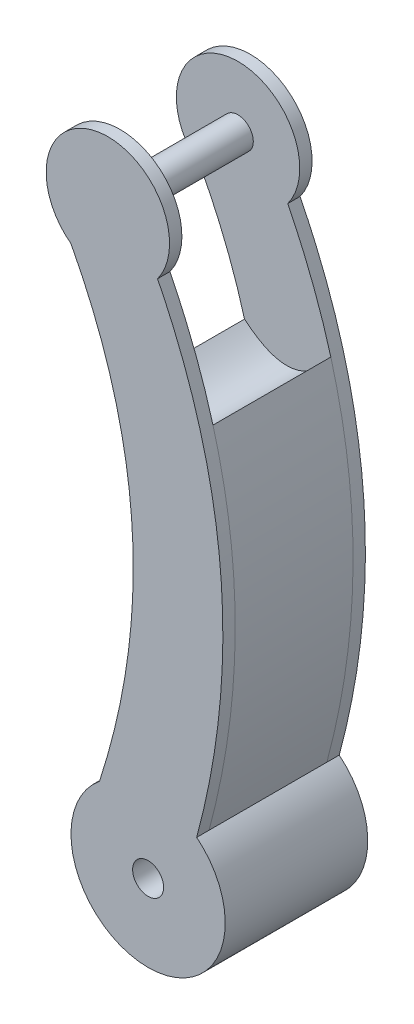
ISO-10303-21;
HEADER;
FILE_DESCRIPTION(('STEP AP214'),'2;1');
FILE_NAME('part.step','',(''),(''),'','','');
FILE_SCHEMA(('AUTOMOTIVE_DESIGN { 1 0 10303 214 1 1 1 1 }'));
ENDSEC;
DATA;
#1=APPLICATION_CONTEXT('core data for automotive mechanical design processes');
#2=APPLICATION_PROTOCOL_DEFINITION('international standard','automotive_design',2000,#1);
#3=PRODUCT_CONTEXT('',#1,'mechanical');
#4=PRODUCT('Part','Part','',(#3));
#5=PRODUCT_RELATED_PRODUCT_CATEGORY('part','',(#4));
#6=PRODUCT_DEFINITION_FORMATION('','',#4);
#7=PRODUCT_DEFINITION_CONTEXT('part definition',#1,'design');
#8=PRODUCT_DEFINITION('design','',#6,#7);
#9=PRODUCT_DEFINITION_SHAPE('','',#8);
#10=(LENGTH_UNIT() NAMED_UNIT(*) SI_UNIT(.MILLI.,.METRE.));
#11=(NAMED_UNIT(*) PLANE_ANGLE_UNIT() SI_UNIT($,.RADIAN.));
#12=(NAMED_UNIT(*) SI_UNIT($,.STERADIAN.) SOLID_ANGLE_UNIT());
#13=UNCERTAINTY_MEASURE_WITH_UNIT(LENGTH_MEASURE(1.E-05),#10,'distance_accuracy_value','');
#14=(GEOMETRIC_REPRESENTATION_CONTEXT(3) GLOBAL_UNCERTAINTY_ASSIGNED_CONTEXT((#13)) GLOBAL_UNIT_ASSIGNED_CONTEXT((#10,
#11,#12)) REPRESENTATION_CONTEXT('',''));
#15=CARTESIAN_POINT('',(0.,0.,0.));
#16=DIRECTION('',(0.,0.,1.));
#17=DIRECTION('',(1.,0.,0.));
#18=AXIS2_PLACEMENT_3D('',#15,#16,#17);
#19=CARTESIAN_POINT('',(-13.0474283517302,181.745231989373,4.));
#20=DIRECTION('',(0.,0.,-1.));
#21=DIRECTION('',(-1.,0.,0.));
#22=AXIS2_PLACEMENT_3D('',#19,#20,#21);
#23=CYLINDRICAL_SURFACE('',#22,20.);
#24=CARTESIAN_POINT('',(-13.0474283517302,181.745231989373,0.));
#25=DIRECTION('',(0.,0.,1.));
#26=DIRECTION('',(1.,0.,0.));
#27=AXIS2_PLACEMENT_3D('',#24,#25,#26);
#28=CIRCLE('',#27,20.);
#29=CARTESIAN_POINT('',(3.06175313738915,169.892204032323,0.));
#30=VERTEX_POINT('',#29);
#31=CARTESIAN_POINT('',(-25.,165.709770318658,0.));
#32=VERTEX_POINT('',#31);
#33=EDGE_CURVE('E128',#30,#32,#28,.T.);
#34=ORIENTED_EDGE('',*,*,#33,.T.);
#35=DIRECTION('',(0.,0.,-1.));
#36=VECTOR('',#35,1.);
#37=CARTESIAN_POINT('',(-25.,165.709770318658,4.));
#38=LINE('',#37,#36);
#39=CARTESIAN_POINT('',(-25.,165.709770318658,4.));
#40=VERTEX_POINT('',#39);
#41=EDGE_CURVE('E298',#40,#32,#38,.T.);
#42=ORIENTED_EDGE('',*,*,#41,.F.);
#43=CARTESIAN_POINT('',(-13.0474283517302,181.745231989373,4.));
#44=DIRECTION('',(0.,0.,1.));
#45=DIRECTION('',(1.,0.,0.));
#46=AXIS2_PLACEMENT_3D('',#43,#44,#45);
#47=CIRCLE('',#46,20.);
#48=CARTESIAN_POINT('',(3.06175313738915,169.892204032323,4.));
#49=VERTEX_POINT('',#48);
#50=EDGE_CURVE('E209',#49,#40,#47,.T.);
#51=ORIENTED_EDGE('',*,*,#50,.F.);
#52=DIRECTION('',(0.,0.,-1.));
#53=VECTOR('',#52,1.);
#54=CARTESIAN_POINT('',(3.06175313738915,169.892204032323,4.));
#55=LINE('',#54,#53);
#56=EDGE_CURVE('E284',#49,#30,#55,.T.);
#57=ORIENTED_EDGE('',*,*,#56,.T.);
#58=EDGE_LOOP('',(#34,#42,#51,#57));
#59=FACE_BOUND('',#58,.T.);
#60=ADVANCED_FACE('F35',(#59),#23,.T.);
#61=CARTESIAN_POINT('',(-15.7524192846488,19.4129154606057,4.));
#62=CARTESIAN_POINT('',(10.0323703400631,99.240514814276,4.));
#63=CARTESIAN_POINT('',(-25.,165.709770318658,4.));
#64=B_SPLINE_CURVE_WITH_KNOTS('',2,(#61,#62,#63),.UNSPECIFIED.,.F.,.F.,(3,3),(0.,1.),.UNSPECIFIED.);
#65=DIRECTION('',(0.,0.,-1.));
#66=VECTOR('',#65,1.);
#67=SURFACE_OF_LINEAR_EXTRUSION('',#64,#66);
#68=CARTESIAN_POINT('',(-15.7524192846488,19.4129154606057,0.));
#69=CARTESIAN_POINT('',(10.0323703400631,99.240514814276,0.));
#70=CARTESIAN_POINT('',(-25.,165.709770318658,0.));
#71=B_SPLINE_CURVE_WITH_KNOTS('',2,(#68,#69,#70),.UNSPECIFIED.,.F.,.F.,(3,3),(0.,1.),.UNSPECIFIED.);
#72=CARTESIAN_POINT('',(-15.7524192846488,19.4129154606057,0.));
#73=VERTEX_POINT('',#72);
#74=EDGE_CURVE('E320',#73,#32,#71,.T.);
#75=ORIENTED_EDGE('',*,*,#74,.F.);
#76=DIRECTION('',(0.,0.,-1.));
#77=VECTOR('',#76,1.);
#78=CARTESIAN_POINT('',(-15.7524192846488,19.4129154606057,4.));
#79=LINE('',#78,#77);
#80=CARTESIAN_POINT('',(-15.7524192846488,19.4129154606057,4.));
#81=VERTEX_POINT('',#80);
#82=EDGE_CURVE('E291',#81,#73,#79,.T.);
#83=ORIENTED_EDGE('',*,*,#82,.F.);
#84=CARTESIAN_POINT('',(-10.9531466825923,130.455943781508,4.));
#85=VERTEX_POINT('',#84);
#86=EDGE_CURVE('E211',#81,#85,#64,.T.);
#87=ORIENTED_EDGE('',*,*,#86,.T.);
#88=EDGE_CURVE('E83',#85,#40,#64,.T.);
#89=ORIENTED_EDGE('',*,*,#88,.T.);
#90=ORIENTED_EDGE('',*,*,#41,.T.);
#91=EDGE_LOOP('',(#75,#83,#87,#89,#90));
#92=FACE_BOUND('',#91,.T.);
#93=ADVANCED_FACE('F224',(#92),#67,.T.);
#94=CARTESIAN_POINT('',(0.,0.,4.));
#95=DIRECTION('',(0.,0.,-1.));
#96=DIRECTION('',(-1.,0.,0.));
#97=AXIS2_PLACEMENT_3D('',#94,#95,#96);
#98=CYLINDRICAL_SURFACE('',#97,25.);
#99=CARTESIAN_POINT('',(0.,0.,0.));
#100=DIRECTION('',(0.,0.,1.));
#101=DIRECTION('',(1.,0.,0.));
#102=AXIS2_PLACEMENT_3D('',#99,#100,#101);
#103=CIRCLE('',#102,25.);
#104=CARTESIAN_POINT('',(15.7524192846488,19.4129154606057,0.));
#105=VERTEX_POINT('',#104);
#106=EDGE_CURVE('E322',#73,#105,#103,.T.);
#107=ORIENTED_EDGE('',*,*,#106,.T.);
#108=DIRECTION('',(0.,0.,-1.));
#109=VECTOR('',#108,1.);
#110=CARTESIAN_POINT('',(15.7524192846488,19.4129154606057,4.));
#111=LINE('',#110,#109);
#112=CARTESIAN_POINT('',(15.7524192846488,19.4129154606057,4.));
#113=VERTEX_POINT('',#112);
#114=EDGE_CURVE('E285',#113,#105,#111,.T.);
#115=ORIENTED_EDGE('',*,*,#114,.F.);
#116=DIRECTION('',(0.,0.,-1.));
#117=VECTOR('',#116,1.);
#118=CARTESIAN_POINT('',(15.7524192804463,19.4129154554266,23.1));
#119=LINE('',#118,#117);
#120=CARTESIAN_POINT('',(15.7524192846488,19.4129154606057,42.2));
#121=VERTEX_POINT('',#120);
#122=EDGE_CURVE('E205',#121,#113,#119,.T.);
#123=ORIENTED_EDGE('',*,*,#122,.F.);
#124=DIRECTION('',(0.,0.,1.));
#125=VECTOR('',#124,1.);
#126=CARTESIAN_POINT('',(15.7524192846488,19.4129154606057,42.2));
#127=LINE('',#126,#125);
#128=CARTESIAN_POINT('',(15.7524192846488,19.4129154606057,46.2));
#129=VERTEX_POINT('',#128);
#130=EDGE_CURVE('E252',#121,#129,#127,.T.);
#131=ORIENTED_EDGE('',*,*,#130,.T.);
#132=CARTESIAN_POINT('',(0.,0.,46.2));
#133=DIRECTION('',(0.,0.,1.));
#134=DIRECTION('',(1.,0.,0.));
#135=AXIS2_PLACEMENT_3D('',#132,#133,#134);
#136=CIRCLE('',#135,25.);
#137=CARTESIAN_POINT('',(-15.7524192846488,19.4129154606057,46.2));
#138=VERTEX_POINT('',#137);
#139=EDGE_CURVE('E261',#138,#129,#136,.T.);
#140=ORIENTED_EDGE('',*,*,#139,.F.);
#141=DIRECTION('',(0.,0.,1.));
#142=VECTOR('',#141,1.);
#143=CARTESIAN_POINT('',(-15.7524192846488,19.4129154606057,42.2));
#144=LINE('',#143,#142);
#145=CARTESIAN_POINT('',(-15.7524192846488,19.4129154606057,42.2));
#146=VERTEX_POINT('',#145);
#147=EDGE_CURVE('E250',#146,#138,#144,.T.);
#148=ORIENTED_EDGE('',*,*,#147,.F.);
#149=DIRECTION('',(0.,0.,-1.));
#150=VECTOR('',#149,1.);
#151=CARTESIAN_POINT('',(-15.7524192997547,19.4129154139304,23.1));
#152=LINE('',#151,#150);
#153=EDGE_CURVE('E129',#146,#81,#152,.T.);
#154=ORIENTED_EDGE('',*,*,#153,.T.);
#155=ORIENTED_EDGE('',*,*,#82,.T.);
#156=EDGE_LOOP('',(#107,#115,#123,#131,#140,#148,#154,#155));
#157=FACE_BOUND('',#156,.T.);
#158=ADVANCED_FACE('F227',(#157),#98,.T.);
#159=CARTESIAN_POINT('',(15.7524192846488,19.4129154606057,4.));
#160=CARTESIAN_POINT('',(37.6301166758022,100.741066360929,4.));
#161=CARTESIAN_POINT('',(3.06175313738916,169.892204032323,4.));
#162=B_SPLINE_CURVE_WITH_KNOTS('',2,(#159,#160,#161),.UNSPECIFIED.,.F.,.F.,(3,3),(0.,1.),.UNSPECIFIED.);
#163=DIRECTION('',(0.,0.,-1.));
#164=VECTOR('',#163,1.);
#165=SURFACE_OF_LINEAR_EXTRUSION('',#162,#164);
#166=CARTESIAN_POINT('',(15.7524192846488,19.4129154606057,0.));
#167=CARTESIAN_POINT('',(37.6301166758022,100.741066360929,0.));
#168=CARTESIAN_POINT('',(3.06175313738916,169.892204032323,0.));
#169=B_SPLINE_CURVE_WITH_KNOTS('',2,(#166,#167,#168),.UNSPECIFIED.,.F.,.F.,(3,3),(0.,1.),.UNSPECIFIED.);
#170=EDGE_CURVE('E77',#105,#30,#169,.T.);
#171=ORIENTED_EDGE('',*,*,#170,.T.);
#172=ORIENTED_EDGE('',*,*,#56,.F.);
#173=CARTESIAN_POINT('',(17.0318746879715,133.795114798273,4.));
#174=VERTEX_POINT('',#173);
#175=EDGE_CURVE('E55',#174,#49,#162,.T.);
#176=ORIENTED_EDGE('',*,*,#175,.F.);
#177=EDGE_CURVE('E216',#113,#174,#162,.T.);
#178=ORIENTED_EDGE('',*,*,#177,.F.);
#179=ORIENTED_EDGE('',*,*,#114,.T.);
#180=EDGE_LOOP('',(#171,#172,#176,#178,#179));
#181=FACE_BOUND('',#180,.T.);
#182=ADVANCED_FACE('F230',(#181),#165,.F.);
#183=CARTESIAN_POINT('',(0.,0.,4.));
#184=DIRECTION('',(0.,0.,1.));
#185=DIRECTION('',(1.,0.,0.));
#186=AXIS2_PLACEMENT_3D('',#183,#184,#185);
#187=PLANE('',#186);
#188=CARTESIAN_POINT('',(-13.1040586388925,181.741755043548,4.));
#189=DIRECTION('',(0.,0.,1.));
#190=DIRECTION('',(1.,0.,0.));
#191=AXIS2_PLACEMENT_3D('',#188,#189,#190);
#192=CIRCLE('',#191,5.);
#193=CARTESIAN_POINT('',(-8.10405863889248,181.741755043548,4.));
#194=VERTEX_POINT('',#193);
#195=EDGE_CURVE('E11',#194,#194,#192,.T.);
#196=ORIENTED_EDGE('',*,*,#195,.F.);
#197=EDGE_LOOP('',(#196));
#198=FACE_BOUND('',#197,.T.);
#199=CARTESIAN_POINT('',(17.0318746878315,133.795114798063,4.));
#200=CARTESIAN_POINT('',(5.56458058941474,116.540527233831,4.));
#201=CARTESIAN_POINT('',(-10.953146694791,130.455943825607,4.));
#202=B_SPLINE_CURVE_WITH_KNOTS('',2,(#199,#200,#201),.UNSPECIFIED.,.F.,.F.,(3,3),(0.,1.),.UNSPECIFIED.);
#203=EDGE_CURVE('E50',#174,#85,#202,.T.);
#204=ORIENTED_EDGE('',*,*,#203,.F.);
#205=ORIENTED_EDGE('',*,*,#175,.T.);
#206=ORIENTED_EDGE('',*,*,#50,.T.);
#207=ORIENTED_EDGE('',*,*,#88,.F.);
#208=EDGE_LOOP('',(#204,#205,#206,#207));
#209=FACE_BOUND('',#208,.T.);
#210=ADVANCED_FACE('F234',(#198,#209),#187,.T.);
#211=CARTESIAN_POINT('',(0.,0.,0.));
#212=DIRECTION('',(0.,0.,1.));
#213=DIRECTION('',(1.,0.,0.));
#214=AXIS2_PLACEMENT_3D('',#211,#212,#213);
#215=PLANE('',#214);
#216=CARTESIAN_POINT('',(0.,0.,0.));
#217=DIRECTION('',(0.,0.,1.));
#218=DIRECTION('',(1.,0.,0.));
#219=AXIS2_PLACEMENT_3D('',#216,#217,#218);
#220=CIRCLE('',#219,5.02);
#221=CARTESIAN_POINT('',(5.02,0.,0.));
#222=VERTEX_POINT('',#221);
#223=EDGE_CURVE('E140',#222,#222,#220,.T.);
#224=ORIENTED_EDGE('',*,*,#223,.T.);
#225=EDGE_LOOP('',(#224));
#226=FACE_BOUND('',#225,.T.);
#227=ORIENTED_EDGE('',*,*,#33,.F.);
#228=ORIENTED_EDGE('',*,*,#170,.F.);
#229=ORIENTED_EDGE('',*,*,#106,.F.);
#230=ORIENTED_EDGE('',*,*,#74,.T.);
#231=EDGE_LOOP('',(#227,#228,#229,#230));
#232=FACE_BOUND('',#231,.T.);
#233=ADVANCED_FACE('F235',(#226,#232),#215,.F.);
#234=CARTESIAN_POINT('',(17.0318746878315,133.795114798063,23.1));
#235=CARTESIAN_POINT('',(5.56458058941474,116.540527233831,23.1));
#236=CARTESIAN_POINT('',(-10.953146694791,130.455943825607,23.1));
#237=B_SPLINE_CURVE_WITH_KNOTS('',2,(#234,#235,#236),.UNSPECIFIED.,.F.,.F.,(3,3),(0.,1.),.UNSPECIFIED.);
#238=DIRECTION('',(0.,0.,-1.));
#239=VECTOR('',#238,1.);
#240=SURFACE_OF_LINEAR_EXTRUSION('',#237,#239);
#241=ORIENTED_EDGE('',*,*,#203,.T.);
#242=DIRECTION('',(0.,0.,-1.));
#243=VECTOR('',#242,1.);
#244=CARTESIAN_POINT('',(-10.9531466825923,130.455943781508,23.1));
#245=LINE('',#244,#243);
#246=CARTESIAN_POINT('',(-10.9531466825923,130.455943781508,42.2));
#247=VERTEX_POINT('',#246);
#248=EDGE_CURVE('E119',#247,#85,#245,.T.);
#249=ORIENTED_EDGE('',*,*,#248,.F.);
#250=CARTESIAN_POINT('',(17.0318746878315,133.795114798063,42.2));
#251=CARTESIAN_POINT('',(5.56458058941474,116.540527233831,42.2));
#252=CARTESIAN_POINT('',(-10.953146694791,130.455943825607,42.2));
#253=B_SPLINE_CURVE_WITH_KNOTS('',2,(#250,#251,#252),.UNSPECIFIED.,.F.,.F.,(3,3),(0.,1.),.UNSPECIFIED.);
#254=CARTESIAN_POINT('',(17.0318746879715,133.795114798273,42.2));
#255=VERTEX_POINT('',#254);
#256=EDGE_CURVE('E123',#255,#247,#253,.T.);
#257=ORIENTED_EDGE('',*,*,#256,.F.);
#258=DIRECTION('',(0.,0.,-1.));
#259=VECTOR('',#258,1.);
#260=CARTESIAN_POINT('',(17.0318746836284,133.795114814138,23.1));
#261=LINE('',#260,#259);
#262=EDGE_CURVE('E200',#255,#174,#261,.T.);
#263=ORIENTED_EDGE('',*,*,#262,.T.);
#264=EDGE_LOOP('',(#241,#249,#257,#263));
#265=FACE_BOUND('',#264,.T.);
#266=ADVANCED_FACE('F121',(#265),#240,.F.);
#267=CARTESIAN_POINT('',(-980664.175882644,-196479.621336373,23.1));
#268=CARTESIAN_POINT('',(976707.845246584,214655.205323712,23.1));
#269=CARTESIAN_POINT('',(-972786.679703265,-232343.868481704,23.1));
#270=B_SPLINE_CURVE_WITH_KNOTS('',2,(#267,#268,#269),.UNSPECIFIED.,.F.,.F.,(3,3),(0.,1.),.UNSPECIFIED.);
#271=DIRECTION('',(0.,0.,-1.));
#272=VECTOR('',#271,1.);
#273=SURFACE_OF_LINEAR_EXTRUSION('',#270,#272);
#274=ORIENTED_EDGE('',*,*,#86,.F.);
#275=ORIENTED_EDGE('',*,*,#153,.F.);
#276=CARTESIAN_POINT('',(-15.7524192846488,19.4129154606057,42.2));
#277=CARTESIAN_POINT('',(10.0323703400631,99.240514814276,42.2));
#278=CARTESIAN_POINT('',(-25.,165.709770318658,42.2));
#279=B_SPLINE_CURVE_WITH_KNOTS('',2,(#276,#277,#278),.UNSPECIFIED.,.F.,.F.,(3,3),(0.,1.),.UNSPECIFIED.);
#280=EDGE_CURVE('E143',#146,#247,#279,.T.);
#281=ORIENTED_EDGE('',*,*,#280,.T.);
#282=ORIENTED_EDGE('',*,*,#248,.T.);
#283=EDGE_LOOP('',(#274,#275,#281,#282));
#284=FACE_BOUND('',#283,.T.);
#285=ADVANCED_FACE('F144',(#284),#273,.F.);
#286=CARTESIAN_POINT('',(-973336.496159581,-230020.796237314,23.1));
#287=CARTESIAN_POINT('',(977532.388948046,210999.672853905,23.1));
#288=CARTESIAN_POINT('',(-981649.026045719,-191488.394275469,23.1));
#289=B_SPLINE_CURVE_WITH_KNOTS('',2,(#286,#287,#288),.UNSPECIFIED.,.F.,.F.,(3,3),(0.,1.),.UNSPECIFIED.);
#290=DIRECTION('',(0.,0.,-1.));
#291=VECTOR('',#290,1.);
#292=SURFACE_OF_LINEAR_EXTRUSION('',#289,#291);
#293=ORIENTED_EDGE('',*,*,#177,.T.);
#294=ORIENTED_EDGE('',*,*,#262,.F.);
#295=CARTESIAN_POINT('',(15.7524192846488,19.4129154606057,42.2));
#296=CARTESIAN_POINT('',(37.6301166758022,100.741066360929,42.2));
#297=CARTESIAN_POINT('',(3.06175313738916,169.892204032323,42.2));
#298=B_SPLINE_CURVE_WITH_KNOTS('',2,(#295,#296,#297),.UNSPECIFIED.,.F.,.F.,(3,3),(0.,1.),.UNSPECIFIED.);
#299=EDGE_CURVE('E161',#121,#255,#298,.T.);
#300=ORIENTED_EDGE('',*,*,#299,.F.);
#301=ORIENTED_EDGE('',*,*,#122,.T.);
#302=EDGE_LOOP('',(#293,#294,#300,#301));
#303=FACE_BOUND('',#302,.T.);
#304=ADVANCED_FACE('F178',(#303),#292,.F.);
#305=CARTESIAN_POINT('',(-13.0474283517302,181.745231989373,42.2));
#306=DIRECTION('',(0.,0.,1.));
#307=DIRECTION('',(-1.,0.,0.));
#308=AXIS2_PLACEMENT_3D('',#305,#306,#307);
#309=CYLINDRICAL_SURFACE('',#308,20.);
#310=CARTESIAN_POINT('',(-13.0474283517302,181.745231989373,46.2));
#311=DIRECTION('',(0.,0.,1.));
#312=DIRECTION('',(1.,0.,0.));
#313=AXIS2_PLACEMENT_3D('',#310,#311,#312);
#314=CIRCLE('',#313,20.);
#315=CARTESIAN_POINT('',(3.06175313738915,169.892204032323,46.2));
#316=VERTEX_POINT('',#315);
#317=CARTESIAN_POINT('',(-25.,165.709770318658,46.2));
#318=VERTEX_POINT('',#317);
#319=EDGE_CURVE('E139',#316,#318,#314,.T.);
#320=ORIENTED_EDGE('',*,*,#319,.F.);
#321=DIRECTION('',(0.,0.,1.));
#322=VECTOR('',#321,1.);
#323=CARTESIAN_POINT('',(3.06175313738915,169.892204032323,42.2));
#324=LINE('',#323,#322);
#325=CARTESIAN_POINT('',(3.06175313738915,169.892204032323,42.2));
#326=VERTEX_POINT('',#325);
#327=EDGE_CURVE('E255',#326,#316,#324,.T.);
#328=ORIENTED_EDGE('',*,*,#327,.F.);
#329=CARTESIAN_POINT('',(-13.0474283517302,181.745231989373,42.2));
#330=DIRECTION('',(0.,0.,1.));
#331=DIRECTION('',(1.,0.,0.));
#332=AXIS2_PLACEMENT_3D('',#329,#330,#331);
#333=CIRCLE('',#332,20.);
#334=CARTESIAN_POINT('',(-25.,165.709770318658,42.2));
#335=VERTEX_POINT('',#334);
#336=EDGE_CURVE('E154',#326,#335,#333,.T.);
#337=ORIENTED_EDGE('',*,*,#336,.T.);
#338=DIRECTION('',(0.,0.,1.));
#339=VECTOR('',#338,1.);
#340=CARTESIAN_POINT('',(-25.,165.709770318658,42.2));
#341=LINE('',#340,#339);
#342=EDGE_CURVE('E152',#335,#318,#341,.T.);
#343=ORIENTED_EDGE('',*,*,#342,.T.);
#344=EDGE_LOOP('',(#320,#328,#337,#343));
#345=FACE_BOUND('',#344,.T.);
#346=ADVANCED_FACE('F174',(#345),#309,.T.);
#347=DIRECTION('',(0.,0.,1.));
#348=VECTOR('',#347,1.);
#349=SURFACE_OF_LINEAR_EXTRUSION('',#279,#348);
#350=CARTESIAN_POINT('',(-15.7524192846488,19.4129154606057,46.2));
#351=CARTESIAN_POINT('',(10.0323703400631,99.240514814276,46.2));
#352=CARTESIAN_POINT('',(-25.,165.709770318658,46.2));
#353=B_SPLINE_CURVE_WITH_KNOTS('',2,(#350,#351,#352),.UNSPECIFIED.,.F.,.F.,(3,3),(0.,1.),.UNSPECIFIED.);
#354=EDGE_CURVE('E267',#138,#318,#353,.T.);
#355=ORIENTED_EDGE('',*,*,#354,.T.);
#356=ORIENTED_EDGE('',*,*,#342,.F.);
#357=EDGE_CURVE('E135',#247,#335,#279,.T.);
#358=ORIENTED_EDGE('',*,*,#357,.F.);
#359=ORIENTED_EDGE('',*,*,#280,.F.);
#360=ORIENTED_EDGE('',*,*,#147,.T.);
#361=EDGE_LOOP('',(#355,#356,#358,#359,#360));
#362=FACE_BOUND('',#361,.T.);
#363=ADVANCED_FACE('F150',(#362),#349,.F.);
#364=DIRECTION('',(0.,0.,1.));
#365=VECTOR('',#364,1.);
#366=SURFACE_OF_LINEAR_EXTRUSION('',#298,#365);
#367=CARTESIAN_POINT('',(15.7524192846488,19.4129154606057,46.2));
#368=CARTESIAN_POINT('',(37.6301166758022,100.741066360929,46.2));
#369=CARTESIAN_POINT('',(3.06175313738916,169.892204032323,46.2));
#370=B_SPLINE_CURVE_WITH_KNOTS('',2,(#367,#368,#369),.UNSPECIFIED.,.F.,.F.,(3,3),(0.,1.),.UNSPECIFIED.);
#371=EDGE_CURVE('E155',#129,#316,#370,.T.);
#372=ORIENTED_EDGE('',*,*,#371,.F.);
#373=ORIENTED_EDGE('',*,*,#130,.F.);
#374=ORIENTED_EDGE('',*,*,#299,.T.);
#375=EDGE_CURVE('E137',#255,#326,#298,.T.);
#376=ORIENTED_EDGE('',*,*,#375,.T.);
#377=ORIENTED_EDGE('',*,*,#327,.T.);
#378=EDGE_LOOP('',(#372,#373,#374,#376,#377));
#379=FACE_BOUND('',#378,.T.);
#380=ADVANCED_FACE('F173',(#379),#366,.T.);
#381=CARTESIAN_POINT('',(0.,0.,42.2));
#382=DIRECTION('',(0.,0.,-1.));
#383=DIRECTION('',(1.,0.,0.));
#384=AXIS2_PLACEMENT_3D('',#381,#382,#383);
#385=PLANE('',#384);
#386=CARTESIAN_POINT('',(-13.1040586388925,181.741755043548,42.2));
#387=DIRECTION('',(0.,0.,-1.));
#388=DIRECTION('',(-1.,0.,0.));
#389=AXIS2_PLACEMENT_3D('',#386,#387,#388);
#390=CIRCLE('',#389,5.);
#391=CARTESIAN_POINT('',(-18.1040586388925,181.741755043548,42.2));
#392=VERTEX_POINT('',#391);
#393=EDGE_CURVE('E38',#392,#392,#390,.T.);
#394=ORIENTED_EDGE('',*,*,#393,.F.);
#395=EDGE_LOOP('',(#394));
#396=FACE_BOUND('',#395,.T.);
#397=ORIENTED_EDGE('',*,*,#256,.T.);
#398=ORIENTED_EDGE('',*,*,#357,.T.);
#399=ORIENTED_EDGE('',*,*,#336,.F.);
#400=ORIENTED_EDGE('',*,*,#375,.F.);
#401=EDGE_LOOP('',(#397,#398,#399,#400));
#402=FACE_BOUND('',#401,.T.);
#403=ADVANCED_FACE('F132',(#396,#402),#385,.T.);
#404=CARTESIAN_POINT('',(0.,0.,46.2));
#405=DIRECTION('',(0.,0.,-1.));
#406=DIRECTION('',(1.,0.,0.));
#407=AXIS2_PLACEMENT_3D('',#404,#405,#406);
#408=PLANE('',#407);
#409=CARTESIAN_POINT('',(0.,0.,46.2));
#410=DIRECTION('',(0.,0.,1.));
#411=DIRECTION('',(1.,0.,0.));
#412=AXIS2_PLACEMENT_3D('',#409,#410,#411);
#413=CIRCLE('',#412,5.02);
#414=CARTESIAN_POINT('',(5.02,0.,46.2));
#415=VERTEX_POINT('',#414);
#416=EDGE_CURVE('E431',#415,#415,#413,.T.);
#417=ORIENTED_EDGE('',*,*,#416,.F.);
#418=EDGE_LOOP('',(#417));
#419=FACE_BOUND('',#418,.T.);
#420=ORIENTED_EDGE('',*,*,#319,.T.);
#421=ORIENTED_EDGE('',*,*,#354,.F.);
#422=ORIENTED_EDGE('',*,*,#139,.T.);
#423=ORIENTED_EDGE('',*,*,#371,.T.);
#424=EDGE_LOOP('',(#420,#421,#422,#423));
#425=FACE_BOUND('',#424,.T.);
#426=ADVANCED_FACE('F277',(#419,#425),#408,.F.);
#427=CARTESIAN_POINT('',(0.,0.,-3.));
#428=DIRECTION('',(0.,0.,1.));
#429=DIRECTION('',(1.,0.,0.));
#430=AXIS2_PLACEMENT_3D('',#427,#428,#429);
#431=CYLINDRICAL_SURFACE('',#430,5.02);
#432=CARTESIAN_POINT('',(5.02,0.,46.2));
#433=CARTESIAN_POINT('',(5.02,0.,45.71875));
#434=CARTESIAN_POINT('',(5.02,0.,45.2375));
#435=CARTESIAN_POINT('',(5.02,0.,44.275));
#436=CARTESIAN_POINT('',(5.02,0.,43.79375));
#437=CARTESIAN_POINT('',(5.02,0.,42.83125));
#438=CARTESIAN_POINT('',(5.02,0.,42.35));
#439=CARTESIAN_POINT('',(5.02,0.,41.3875));
#440=CARTESIAN_POINT('',(5.02,0.,40.90625));
#441=CARTESIAN_POINT('',(5.02,0.,39.94375));
#442=CARTESIAN_POINT('',(5.02,0.,39.4625));
#443=CARTESIAN_POINT('',(5.02,0.,38.5));
#444=CARTESIAN_POINT('',(5.02,0.,38.01875));
#445=CARTESIAN_POINT('',(5.02,0.,37.05625));
#446=CARTESIAN_POINT('',(5.02,0.,36.575));
#447=CARTESIAN_POINT('',(5.02,0.,35.6125));
#448=CARTESIAN_POINT('',(5.02,0.,35.13125));
#449=CARTESIAN_POINT('',(5.02,0.,34.16875));
#450=CARTESIAN_POINT('',(5.02,0.,33.6875));
#451=CARTESIAN_POINT('',(5.02,0.,32.725));
#452=CARTESIAN_POINT('',(5.02,0.,32.24375));
#453=CARTESIAN_POINT('',(5.02,0.,31.28125));
#454=CARTESIAN_POINT('',(5.02,0.,30.8));
#455=CARTESIAN_POINT('',(5.02,0.,29.8375));
#456=CARTESIAN_POINT('',(5.02,0.,29.35625));
#457=CARTESIAN_POINT('',(5.02,0.,28.39375));
#458=CARTESIAN_POINT('',(5.02,0.,27.9125));
#459=CARTESIAN_POINT('',(5.02,0.,26.95));
#460=CARTESIAN_POINT('',(5.02,0.,26.46875));
#461=CARTESIAN_POINT('',(5.02,0.,25.50625));
#462=CARTESIAN_POINT('',(5.02,0.,25.025));
#463=CARTESIAN_POINT('',(5.02,0.,24.0625));
#464=CARTESIAN_POINT('',(5.02,0.,23.58125));
#465=CARTESIAN_POINT('',(5.02,0.,22.61875));
#466=CARTESIAN_POINT('',(5.02,0.,22.1375));
#467=CARTESIAN_POINT('',(5.02,0.,21.175));
#468=CARTESIAN_POINT('',(5.02,0.,20.69375));
#469=CARTESIAN_POINT('',(5.02,0.,19.73125));
#470=CARTESIAN_POINT('',(5.02,0.,19.25));
#471=CARTESIAN_POINT('',(5.02,0.,18.2875));
#472=CARTESIAN_POINT('',(5.02,0.,17.80625));
#473=CARTESIAN_POINT('',(5.02,0.,16.84375));
#474=CARTESIAN_POINT('',(5.02,0.,16.3625));
#475=CARTESIAN_POINT('',(5.02,0.,15.4));
#476=CARTESIAN_POINT('',(5.02,0.,14.91875));
#477=CARTESIAN_POINT('',(5.02,0.,13.95625));
#478=CARTESIAN_POINT('',(5.02,0.,13.475));
#479=CARTESIAN_POINT('',(5.02,0.,12.5125));
#480=CARTESIAN_POINT('',(5.02,0.,12.03125));
#481=CARTESIAN_POINT('',(5.02,0.,11.06875));
#482=CARTESIAN_POINT('',(5.02,0.,10.5875));
#483=CARTESIAN_POINT('',(5.02,0.,9.625));
#484=CARTESIAN_POINT('',(5.02,0.,9.14375));
#485=CARTESIAN_POINT('',(5.02,0.,8.18125));
#486=CARTESIAN_POINT('',(5.02,0.,7.7));
#487=CARTESIAN_POINT('',(5.02,0.,6.7375));
#488=CARTESIAN_POINT('',(5.02,0.,6.25625));
#489=CARTESIAN_POINT('',(5.02,0.,5.29375));
#490=CARTESIAN_POINT('',(5.02,0.,4.8125));
#491=CARTESIAN_POINT('',(5.02,0.,3.85));
#492=CARTESIAN_POINT('',(5.02,0.,3.36875));
#493=CARTESIAN_POINT('',(5.02,0.,2.40625));
#494=CARTESIAN_POINT('',(5.02,0.,1.925));
#495=CARTESIAN_POINT('',(5.02,0.,0.9625));
#496=CARTESIAN_POINT('',(5.02,0.,0.48125));
#497=CARTESIAN_POINT('',(5.02,0.,0.));
#498=B_SPLINE_CURVE_WITH_KNOTS('',3,(#432,#433,#434,#435,#436,#437,#438,#439,#440,#441,#442,
#443,#444,#445,#446,#447,#448,#449,#450,#451,#452,#453,#454,#455,#456,#457,#458,#459,#460,#461,
#462,#463,#464,#465,#466,#467,#468,#469,#470,#471,#472,#473,#474,#475,#476,#477,#478,#479,#480,
#481,#482,#483,#484,#485,#486,#487,#488,#489,#490,#491,#492,#493,#494,#495,#496,#497),
.UNSPECIFIED.,.F.,.F.,(4,2,2,2,2,2,2,2,2,2,2,2,2,2,2,2,2,2,2,2,2,2,2,2,2,2,2,2,2,2,2,2,4),(0.,
1.44375,2.8875,4.33125,5.775,7.21875,8.6625,10.10625,11.55,12.99375,14.4375,15.88125,17.325,
18.76875,20.2125,21.65625,23.1,24.54375,25.9875,27.43125,28.875,30.31875,31.7625,33.20625,34.65,
36.09375,37.5375,38.98125,40.425,41.86875,43.3125,44.75625,46.2),.UNSPECIFIED.);
#499=EDGE_CURVE('BSEAM312',#415,#222,#498,.T.);
#500=ORIENTED_EDGE('',*,*,#416,.T.);
#501=ORIENTED_EDGE('',*,*,#223,.F.);
#502=ORIENTED_EDGE('',*,*,#499,.T.);
#503=ORIENTED_EDGE('',*,*,#499,.F.);
#504=EDGE_LOOP('',(#500,#502,#501,#503));
#505=FACE_BOUND('',#504,.T.);
#506=ADVANCED_FACE('F312',(#505),#431,.F.);
#507=CARTESIAN_POINT('',(-13.1040586388925,181.741755043548,1.8));
#508=DIRECTION('',(0.,0.,1.));
#509=DIRECTION('',(1.,0.,0.));
#510=AXIS2_PLACEMENT_3D('',#507,#508,#509);
#511=CYLINDRICAL_SURFACE('',#510,5.);
#512=ORIENTED_EDGE('',*,*,#195,.T.);
#513=EDGE_LOOP('',(#512));
#514=FACE_BOUND('',#513,.T.);
#515=ORIENTED_EDGE('',*,*,#393,.T.);
#516=EDGE_LOOP('',(#515));
#517=FACE_BOUND('',#516,.T.);
#518=ADVANCED_FACE('F304',(#514,#517),#511,.T.);
#519=CLOSED_SHELL('',(#60,#93,#158,#182,#210,#233,#266,#285,#304,#346,#363,#380,#403,#426,#506,#518));
#520=MANIFOLD_SOLID_BREP('B2',#519);
#521=ADVANCED_BREP_SHAPE_REPRESENTATION('',(#18,#520),#14);
#522=SHAPE_DEFINITION_REPRESENTATION(#9,#521);
ENDSEC;
END-ISO-10303-21;
